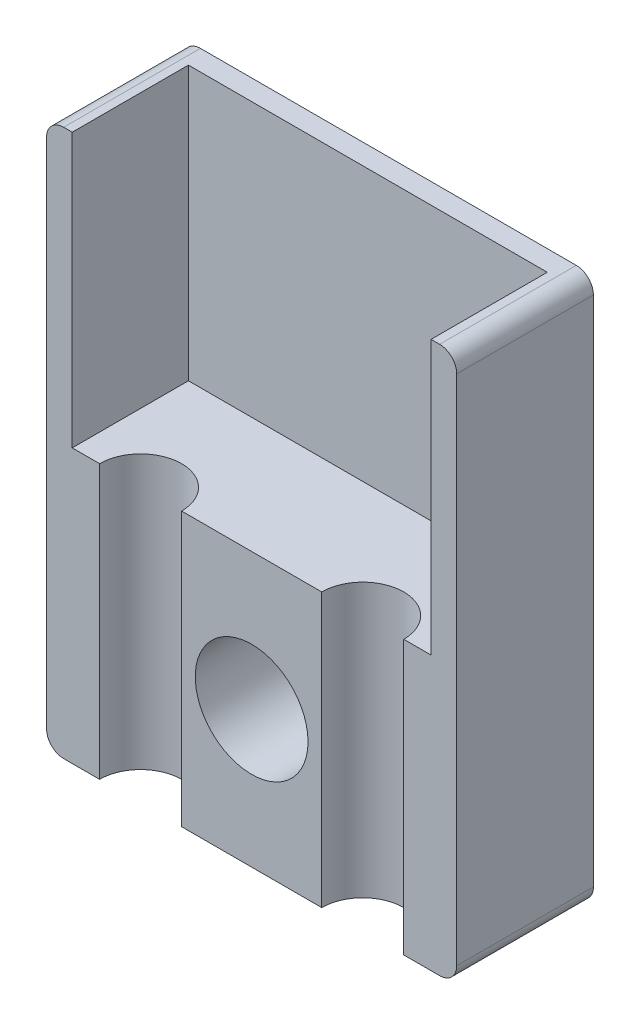
ISO-10303-21;
HEADER;
FILE_DESCRIPTION(('STEP AP214'),'2;1');
FILE_NAME('part.step','',(''),(''),'','','');
FILE_SCHEMA(('AUTOMOTIVE_DESIGN { 1 0 10303 214 1 1 1 1 }'));
ENDSEC;
DATA;
#1=APPLICATION_CONTEXT('core data for automotive mechanical design processes');
#2=APPLICATION_PROTOCOL_DEFINITION('international standard','automotive_design',2000,#1);
#3=PRODUCT_CONTEXT('',#1,'mechanical');
#4=PRODUCT('Part','Part','',(#3));
#5=PRODUCT_RELATED_PRODUCT_CATEGORY('part','',(#4));
#6=PRODUCT_DEFINITION_FORMATION('','',#4);
#7=PRODUCT_DEFINITION_CONTEXT('part definition',#1,'design');
#8=PRODUCT_DEFINITION('design','',#6,#7);
#9=PRODUCT_DEFINITION_SHAPE('','',#8);
#10=(LENGTH_UNIT() NAMED_UNIT(*) SI_UNIT(.MILLI.,.METRE.));
#11=(NAMED_UNIT(*) PLANE_ANGLE_UNIT() SI_UNIT($,.RADIAN.));
#12=(NAMED_UNIT(*) SI_UNIT($,.STERADIAN.) SOLID_ANGLE_UNIT());
#13=UNCERTAINTY_MEASURE_WITH_UNIT(LENGTH_MEASURE(1.E-05),#10,'distance_accuracy_value','');
#14=(GEOMETRIC_REPRESENTATION_CONTEXT(3) GLOBAL_UNCERTAINTY_ASSIGNED_CONTEXT((#13)) GLOBAL_UNIT_ASSIGNED_CONTEXT((#10,
#11,#12)) REPRESENTATION_CONTEXT('',''));
#15=CARTESIAN_POINT('',(0.,0.,0.));
#16=DIRECTION('',(0.,0.,1.));
#17=DIRECTION('',(1.,0.,0.));
#18=AXIS2_PLACEMENT_3D('',#15,#16,#17);
#19=CARTESIAN_POINT('',(11.5,15.5,4.));
#20=DIRECTION('',(0.,0.,-1.));
#21=DIRECTION('',(-1.,0.,0.));
#22=AXIS2_PLACEMENT_3D('',#19,#20,#21);
#23=PLANE('',#22);
#24=CARTESIAN_POINT('',(6.,4.,4.));
#25=DIRECTION('',(0.,0.,1.));
#26=DIRECTION('',(1.,0.,0.));
#27=AXIS2_PLACEMENT_3D('',#24,#25,#26);
#28=CIRCLE('',#27,1.65);
#29=CARTESIAN_POINT('',(7.65,4.,4.));
#30=VERTEX_POINT('',#29);
#31=EDGE_CURVE('E222',#30,#30,#28,.T.);
#32=ORIENTED_EDGE('',*,*,#31,.F.);
#33=EDGE_LOOP('',(#32));
#34=FACE_BOUND('',#33,.T.);
#35=DIRECTION('',(-1.,0.,0.));
#36=VECTOR('',#35,1.);
#37=CARTESIAN_POINT('',(11.25,8.,4.));
#38=LINE('',#37,#36);
#39=CARTESIAN_POINT('',(8.05,8.,4.));
#40=VERTEX_POINT('',#39);
#41=CARTESIAN_POINT('',(3.95,8.,4.));
#42=VERTEX_POINT('',#41);
#43=EDGE_CURVE('E345',#40,#42,#38,.T.);
#44=ORIENTED_EDGE('',*,*,#43,.T.);
#45=DIRECTION('',(0.,-1.,0.));
#46=VECTOR('',#45,1.);
#47=CARTESIAN_POINT('',(3.95,18.6832815729997,4.));
#48=LINE('',#47,#46);
#49=CARTESIAN_POINT('',(3.95,0.,4.));
#50=VERTEX_POINT('',#49);
#51=EDGE_CURVE('E208',#42,#50,#48,.T.);
#52=ORIENTED_EDGE('',*,*,#51,.T.);
#53=DIRECTION('',(1.,0.,0.));
#54=VECTOR('',#53,1.);
#55=CARTESIAN_POINT('',(0.500000000000004,0.,4.));
#56=LINE('',#55,#54);
#57=CARTESIAN_POINT('',(8.05,0.,4.));
#58=VERTEX_POINT('',#57);
#59=EDGE_CURVE('E254',#50,#58,#56,.T.);
#60=ORIENTED_EDGE('',*,*,#59,.T.);
#61=DIRECTION('',(0.,-1.,0.));
#62=VECTOR('',#61,1.);
#63=CARTESIAN_POINT('',(8.05,18.6832815729997,4.));
#64=LINE('',#63,#62);
#65=EDGE_CURVE('E64',#40,#58,#64,.T.);
#66=ORIENTED_EDGE('',*,*,#65,.F.);
#67=EDGE_LOOP('',(#44,#52,#60,#66));
#68=FACE_BOUND('',#67,.T.);
#69=ADVANCED_FACE('F41',(#34,#68),#23,.F.);
#70=CARTESIAN_POINT('',(9.25,18.6832815729997,4.));
#71=DIRECTION('',(0.,-1.,0.));
#72=DIRECTION('',(0.,0.,-1.));
#73=AXIS2_PLACEMENT_3D('',#70,#71,#72);
#74=CYLINDRICAL_SURFACE('',#73,1.2);
#75=CARTESIAN_POINT('',(9.25,8.,4.));
#76=DIRECTION('',(0.,1.,0.));
#77=DIRECTION('',(0.,0.,1.));
#78=AXIS2_PLACEMENT_3D('',#75,#76,#77);
#79=CIRCLE('',#78,1.2);
#80=CARTESIAN_POINT('',(10.45,8.,4.));
#81=VERTEX_POINT('',#80);
#82=EDGE_CURVE('E199',#40,#81,#79,.F.);
#83=ORIENTED_EDGE('',*,*,#82,.F.);
#84=ORIENTED_EDGE('',*,*,#65,.T.);
#85=CARTESIAN_POINT('',(9.25,0.,4.));
#86=DIRECTION('',(0.,-1.,0.));
#87=DIRECTION('',(0.,0.,-1.));
#88=AXIS2_PLACEMENT_3D('',#85,#86,#87);
#89=CIRCLE('',#88,1.2);
#90=CARTESIAN_POINT('',(10.45,0.,4.));
#91=VERTEX_POINT('',#90);
#92=EDGE_CURVE('E203',#58,#91,#89,.T.);
#93=ORIENTED_EDGE('',*,*,#92,.T.);
#94=DIRECTION('',(0.,-1.,0.));
#95=VECTOR('',#94,1.);
#96=CARTESIAN_POINT('',(10.45,18.6832815729997,4.));
#97=LINE('',#96,#95);
#98=EDGE_CURVE('E217',#81,#91,#97,.T.);
#99=ORIENTED_EDGE('',*,*,#98,.F.);
#100=EDGE_LOOP('',(#83,#84,#93,#99));
#101=FACE_BOUND('',#100,.T.);
#102=ADVANCED_FACE('F384',(#101),#74,.F.);
#103=CARTESIAN_POINT('',(2.75,18.6832815729997,4.));
#104=DIRECTION('',(0.,-1.,0.));
#105=DIRECTION('',(0.,0.,-1.));
#106=AXIS2_PLACEMENT_3D('',#103,#104,#105);
#107=CYLINDRICAL_SURFACE('',#106,1.2);
#108=CARTESIAN_POINT('',(2.75,8.,4.));
#109=DIRECTION('',(0.,1.,0.));
#110=DIRECTION('',(0.,0.,1.));
#111=AXIS2_PLACEMENT_3D('',#108,#109,#110);
#112=CIRCLE('',#111,1.2);
#113=CARTESIAN_POINT('',(1.55,8.,4.));
#114=VERTEX_POINT('',#113);
#115=EDGE_CURVE('E12',#114,#42,#112,.F.);
#116=ORIENTED_EDGE('',*,*,#115,.F.);
#117=DIRECTION('',(0.,-1.,0.));
#118=VECTOR('',#117,1.);
#119=CARTESIAN_POINT('',(1.55,18.6832815729997,4.));
#120=LINE('',#119,#118);
#121=CARTESIAN_POINT('',(1.55,0.,4.));
#122=VERTEX_POINT('',#121);
#123=EDGE_CURVE('E209',#114,#122,#120,.T.);
#124=ORIENTED_EDGE('',*,*,#123,.T.);
#125=CARTESIAN_POINT('',(2.75,0.,4.));
#126=DIRECTION('',(0.,-1.,0.));
#127=DIRECTION('',(0.,0.,-1.));
#128=AXIS2_PLACEMENT_3D('',#125,#126,#127);
#129=CIRCLE('',#128,1.2);
#130=EDGE_CURVE('E204',#122,#50,#129,.T.);
#131=ORIENTED_EDGE('',*,*,#130,.T.);
#132=ORIENTED_EDGE('',*,*,#51,.F.);
#133=EDGE_LOOP('',(#116,#124,#131,#132));
#134=FACE_BOUND('',#133,.T.);
#135=ADVANCED_FACE('F390',(#134),#107,.F.);
#136=DIRECTION('',(-1.,0.,0.));
#137=VECTOR('',#136,1.);
#138=CARTESIAN_POINT('',(0.500000000000004,16.,4.));
#139=LINE('',#138,#137);
#140=CARTESIAN_POINT('',(11.5,16.,4.));
#141=VERTEX_POINT('',#140);
#142=CARTESIAN_POINT('',(11.25,16.,4.));
#143=VERTEX_POINT('',#142);
#144=EDGE_CURVE('E236',#141,#143,#139,.T.);
#145=ORIENTED_EDGE('',*,*,#144,.T.);
#146=DIRECTION('',(0.,1.,0.));
#147=VECTOR('',#146,1.);
#148=CARTESIAN_POINT('',(11.25,-11.0367567699936,4.));
#149=LINE('',#148,#147);
#150=CARTESIAN_POINT('',(11.25,8.,4.));
#151=VERTEX_POINT('',#150);
#152=EDGE_CURVE('E175',#151,#143,#149,.T.);
#153=ORIENTED_EDGE('',*,*,#152,.F.);
#154=EDGE_CURVE('E342',#151,#81,#38,.T.);
#155=ORIENTED_EDGE('',*,*,#154,.T.);
#156=ORIENTED_EDGE('',*,*,#98,.T.);
#157=CARTESIAN_POINT('',(11.5,0.,4.));
#158=VERTEX_POINT('',#157);
#159=EDGE_CURVE('E248',#91,#158,#56,.T.);
#160=ORIENTED_EDGE('',*,*,#159,.T.);
#161=CARTESIAN_POINT('',(11.5,0.5,4.));
#162=DIRECTION('',(0.,0.,1.));
#163=DIRECTION('',(1.,0.,0.));
#164=AXIS2_PLACEMENT_3D('',#161,#162,#163);
#165=CIRCLE('',#164,0.5);
#166=CARTESIAN_POINT('',(12.,0.5,4.));
#167=VERTEX_POINT('',#166);
#168=EDGE_CURVE('E253',#158,#167,#165,.T.);
#169=ORIENTED_EDGE('',*,*,#168,.T.);
#170=DIRECTION('',(0.,1.,0.));
#171=VECTOR('',#170,1.);
#172=CARTESIAN_POINT('',(12.,0.500000000000004,4.));
#173=LINE('',#172,#171);
#174=CARTESIAN_POINT('',(12.,15.5,4.));
#175=VERTEX_POINT('',#174);
#176=EDGE_CURVE('E257',#167,#175,#173,.T.);
#177=ORIENTED_EDGE('',*,*,#176,.T.);
#178=CARTESIAN_POINT('',(11.5,15.5,4.));
#179=DIRECTION('',(0.,0.,1.));
#180=DIRECTION('',(-1.,0.,0.));
#181=AXIS2_PLACEMENT_3D('',#178,#179,#180);
#182=CIRCLE('',#181,0.5);
#183=EDGE_CURVE('E230',#175,#141,#182,.T.);
#184=ORIENTED_EDGE('',*,*,#183,.T.);
#185=EDGE_LOOP('',(#145,#153,#155,#156,#160,#169,#177,#184));
#186=FACE_BOUND('',#185,.T.);
#187=ADVANCED_FACE('F357',(#186),#23,.F.);
#188=CARTESIAN_POINT('',(0.750000000000004,8.,4.));
#189=VERTEX_POINT('',#188);
#190=EDGE_CURVE('E56',#114,#189,#38,.T.);
#191=ORIENTED_EDGE('',*,*,#190,.T.);
#192=DIRECTION('',(0.,1.,0.));
#193=VECTOR('',#192,1.);
#194=CARTESIAN_POINT('',(0.750000000000004,-11.0367567699936,4.));
#195=LINE('',#194,#193);
#196=CARTESIAN_POINT('',(0.750000000000004,16.,4.));
#197=VERTEX_POINT('',#196);
#198=EDGE_CURVE('E191',#189,#197,#195,.T.);
#199=ORIENTED_EDGE('',*,*,#198,.T.);
#200=CARTESIAN_POINT('',(0.500000000000004,16.,4.));
#201=VERTEX_POINT('',#200);
#202=EDGE_CURVE('E234',#197,#201,#139,.T.);
#203=ORIENTED_EDGE('',*,*,#202,.T.);
#204=CARTESIAN_POINT('',(0.5,15.5,4.));
#205=DIRECTION('',(0.,0.,1.));
#206=DIRECTION('',(-1.,0.,0.));
#207=AXIS2_PLACEMENT_3D('',#204,#205,#206);
#208=CIRCLE('',#207,0.5);
#209=CARTESIAN_POINT('',(0.,15.5,4.));
#210=VERTEX_POINT('',#209);
#211=EDGE_CURVE('E239',#201,#210,#208,.T.);
#212=ORIENTED_EDGE('',*,*,#211,.T.);
#213=DIRECTION('',(0.,-1.,0.));
#214=VECTOR('',#213,1.);
#215=CARTESIAN_POINT('',(0.,0.500000000000004,4.));
#216=LINE('',#215,#214);
#217=CARTESIAN_POINT('',(0.,0.500000000000004,4.));
#218=VERTEX_POINT('',#217);
#219=EDGE_CURVE('E242',#210,#218,#216,.T.);
#220=ORIENTED_EDGE('',*,*,#219,.T.);
#221=CARTESIAN_POINT('',(0.5,0.5,4.));
#222=DIRECTION('',(0.,0.,1.));
#223=DIRECTION('',(-1.,0.,0.));
#224=AXIS2_PLACEMENT_3D('',#221,#222,#223);
#225=CIRCLE('',#224,0.5);
#226=CARTESIAN_POINT('',(0.500000000000004,0.,4.));
#227=VERTEX_POINT('',#226);
#228=EDGE_CURVE('E245',#218,#227,#225,.T.);
#229=ORIENTED_EDGE('',*,*,#228,.T.);
#230=EDGE_CURVE('E249',#227,#122,#56,.T.);
#231=ORIENTED_EDGE('',*,*,#230,.T.);
#232=ORIENTED_EDGE('',*,*,#123,.F.);
#233=EDGE_LOOP('',(#191,#199,#203,#212,#220,#229,#231,#232));
#234=FACE_BOUND('',#233,.T.);
#235=ADVANCED_FACE('F336',(#234),#23,.F.);
#236=CARTESIAN_POINT('',(11.5,15.5,0.));
#237=DIRECTION('',(0.,0.,-1.));
#238=DIRECTION('',(-1.,0.,0.));
#239=AXIS2_PLACEMENT_3D('',#236,#237,#238);
#240=PLANE('',#239);
#241=CARTESIAN_POINT('',(11.5,15.5,0.));
#242=DIRECTION('',(0.,0.,1.));
#243=DIRECTION('',(-1.,0.,0.));
#244=AXIS2_PLACEMENT_3D('',#241,#242,#243);
#245=CIRCLE('',#244,0.5);
#246=CARTESIAN_POINT('',(12.,15.5,0.));
#247=VERTEX_POINT('',#246);
#248=CARTESIAN_POINT('',(11.5,16.,0.));
#249=VERTEX_POINT('',#248);
#250=EDGE_CURVE('E226',#247,#249,#245,.T.);
#251=ORIENTED_EDGE('',*,*,#250,.F.);
#252=DIRECTION('',(0.,1.,0.));
#253=VECTOR('',#252,1.);
#254=CARTESIAN_POINT('',(12.,0.500000000000004,0.));
#255=LINE('',#254,#253);
#256=CARTESIAN_POINT('',(12.,0.5,0.));
#257=VERTEX_POINT('',#256);
#258=EDGE_CURVE('E235',#257,#247,#255,.T.);
#259=ORIENTED_EDGE('',*,*,#258,.F.);
#260=CARTESIAN_POINT('',(11.5,0.5,0.));
#261=DIRECTION('',(0.,0.,1.));
#262=DIRECTION('',(1.,0.,0.));
#263=AXIS2_PLACEMENT_3D('',#260,#261,#262);
#264=CIRCLE('',#263,0.5);
#265=CARTESIAN_POINT('',(11.5,0.,0.));
#266=VERTEX_POINT('',#265);
#267=EDGE_CURVE('E279',#266,#257,#264,.T.);
#268=ORIENTED_EDGE('',*,*,#267,.F.);
#269=DIRECTION('',(1.,0.,0.));
#270=VECTOR('',#269,1.);
#271=CARTESIAN_POINT('',(0.500000000000004,0.,0.));
#272=LINE('',#271,#270);
#273=CARTESIAN_POINT('',(0.500000000000004,0.,0.));
#274=VERTEX_POINT('',#273);
#275=EDGE_CURVE('E276',#274,#266,#272,.T.);
#276=ORIENTED_EDGE('',*,*,#275,.F.);
#277=CARTESIAN_POINT('',(0.5,0.5,0.));
#278=DIRECTION('',(0.,0.,1.));
#279=DIRECTION('',(-1.,0.,0.));
#280=AXIS2_PLACEMENT_3D('',#277,#278,#279);
#281=CIRCLE('',#280,0.5);
#282=CARTESIAN_POINT('',(0.,0.500000000000004,0.));
#283=VERTEX_POINT('',#282);
#284=EDGE_CURVE('E273',#283,#274,#281,.T.);
#285=ORIENTED_EDGE('',*,*,#284,.F.);
#286=DIRECTION('',(0.,-1.,0.));
#287=VECTOR('',#286,1.);
#288=CARTESIAN_POINT('',(0.,0.500000000000004,0.));
#289=LINE('',#288,#287);
#290=CARTESIAN_POINT('',(0.,15.5,0.));
#291=VERTEX_POINT('',#290);
#292=EDGE_CURVE('E270',#291,#283,#289,.T.);
#293=ORIENTED_EDGE('',*,*,#292,.F.);
#294=CARTESIAN_POINT('',(0.5,15.5,0.));
#295=DIRECTION('',(0.,0.,1.));
#296=DIRECTION('',(-1.,0.,0.));
#297=AXIS2_PLACEMENT_3D('',#294,#295,#296);
#298=CIRCLE('',#297,0.5);
#299=CARTESIAN_POINT('',(0.500000000000004,16.,0.));
#300=VERTEX_POINT('',#299);
#301=EDGE_CURVE('E267',#300,#291,#298,.T.);
#302=ORIENTED_EDGE('',*,*,#301,.F.);
#303=DIRECTION('',(-1.,0.,0.));
#304=VECTOR('',#303,1.);
#305=CARTESIAN_POINT('',(0.500000000000004,16.,0.));
#306=LINE('',#305,#304);
#307=EDGE_CURVE('E264',#249,#300,#306,.T.);
#308=ORIENTED_EDGE('',*,*,#307,.F.);
#309=EDGE_LOOP('',(#251,#259,#268,#276,#285,#293,#302,#308));
#310=FACE_BOUND('',#309,.T.);
#311=CARTESIAN_POINT('',(6.,4.,0.));
#312=DIRECTION('',(0.,0.,1.));
#313=DIRECTION('',(1.,0.,0.));
#314=AXIS2_PLACEMENT_3D('',#311,#312,#313);
#315=CIRCLE('',#314,1.65);
#316=CARTESIAN_POINT('',(7.65,4.,0.));
#317=VERTEX_POINT('',#316);
#318=EDGE_CURVE('E212',#317,#317,#315,.T.);
#319=ORIENTED_EDGE('',*,*,#318,.T.);
#320=EDGE_LOOP('',(#319));
#321=FACE_BOUND('',#320,.T.);
#322=ADVANCED_FACE('F320',(#310,#321),#240,.T.);
#323=CARTESIAN_POINT('',(11.5,15.5,4.));
#324=DIRECTION('',(0.,0.,-1.));
#325=DIRECTION('',(-1.,0.,0.));
#326=AXIS2_PLACEMENT_3D('',#323,#324,#325);
#327=CYLINDRICAL_SURFACE('',#326,0.5);
#328=ORIENTED_EDGE('',*,*,#250,.T.);
#329=DIRECTION('',(0.,0.,-1.));
#330=VECTOR('',#329,1.);
#331=CARTESIAN_POINT('',(11.5,16.,4.));
#332=LINE('',#331,#330);
#333=EDGE_CURVE('E50',#141,#249,#332,.T.);
#334=ORIENTED_EDGE('',*,*,#333,.F.);
#335=ORIENTED_EDGE('',*,*,#183,.F.);
#336=DIRECTION('',(0.,0.,-1.));
#337=VECTOR('',#336,1.);
#338=CARTESIAN_POINT('',(12.,15.5,4.));
#339=LINE('',#338,#337);
#340=EDGE_CURVE('E260',#175,#247,#339,.T.);
#341=ORIENTED_EDGE('',*,*,#340,.T.);
#342=EDGE_LOOP('',(#328,#334,#335,#341));
#343=FACE_BOUND('',#342,.T.);
#344=ADVANCED_FACE('F43',(#343),#327,.T.);
#345=CARTESIAN_POINT('',(0.500000000000004,16.,4.));
#346=DIRECTION('',(0.,-1.,0.));
#347=DIRECTION('',(0.,0.,-1.));
#348=AXIS2_PLACEMENT_3D('',#345,#346,#347);
#349=PLANE('',#348);
#350=DIRECTION('',(-1.,0.,0.));
#351=VECTOR('',#350,1.);
#352=CARTESIAN_POINT('',(11.25,16.,0.6));
#353=LINE('',#352,#351);
#354=CARTESIAN_POINT('',(11.25,16.,0.6));
#355=VERTEX_POINT('',#354);
#356=CARTESIAN_POINT('',(0.750000000000004,16.,0.6));
#357=VERTEX_POINT('',#356);
#358=EDGE_CURVE('E161',#355,#357,#353,.T.);
#359=ORIENTED_EDGE('',*,*,#358,.F.);
#360=DIRECTION('',(0.,0.,-1.));
#361=VECTOR('',#360,1.);
#362=CARTESIAN_POINT('',(11.25,16.,4.));
#363=LINE('',#362,#361);
#364=EDGE_CURVE('E172',#143,#355,#363,.T.);
#365=ORIENTED_EDGE('',*,*,#364,.F.);
#366=ORIENTED_EDGE('',*,*,#144,.F.);
#367=ORIENTED_EDGE('',*,*,#333,.T.);
#368=ORIENTED_EDGE('',*,*,#307,.T.);
#369=DIRECTION('',(0.,0.,-1.));
#370=VECTOR('',#369,1.);
#371=CARTESIAN_POINT('',(0.500000000000004,16.,4.));
#372=LINE('',#371,#370);
#373=EDGE_CURVE('E307',#201,#300,#372,.T.);
#374=ORIENTED_EDGE('',*,*,#373,.F.);
#375=ORIENTED_EDGE('',*,*,#202,.F.);
#376=DIRECTION('',(0.,0.,1.));
#377=VECTOR('',#376,1.);
#378=CARTESIAN_POINT('',(0.750000000000004,16.,4.));
#379=LINE('',#378,#377);
#380=EDGE_CURVE('E169',#357,#197,#379,.T.);
#381=ORIENTED_EDGE('',*,*,#380,.F.);
#382=EDGE_LOOP('',(#359,#365,#366,#367,#368,#374,#375,#381));
#383=FACE_BOUND('',#382,.T.);
#384=ADVANCED_FACE('F180',(#383),#349,.F.);
#385=CARTESIAN_POINT('',(0.5,15.5,4.));
#386=DIRECTION('',(0.,0.,-1.));
#387=DIRECTION('',(-1.,0.,0.));
#388=AXIS2_PLACEMENT_3D('',#385,#386,#387);
#389=CYLINDRICAL_SURFACE('',#388,0.5);
#390=ORIENTED_EDGE('',*,*,#301,.T.);
#391=DIRECTION('',(0.,0.,-1.));
#392=VECTOR('',#391,1.);
#393=CARTESIAN_POINT('',(0.,15.5,4.));
#394=LINE('',#393,#392);
#395=EDGE_CURVE('E303',#210,#291,#394,.T.);
#396=ORIENTED_EDGE('',*,*,#395,.F.);
#397=ORIENTED_EDGE('',*,*,#211,.F.);
#398=ORIENTED_EDGE('',*,*,#373,.T.);
#399=EDGE_LOOP('',(#390,#396,#397,#398));
#400=FACE_BOUND('',#399,.T.);
#401=ADVANCED_FACE('F328',(#400),#389,.T.);
#402=CARTESIAN_POINT('',(0.,0.500000000000004,4.));
#403=DIRECTION('',(1.,0.,0.));
#404=DIRECTION('',(0.,0.,-1.));
#405=AXIS2_PLACEMENT_3D('',#402,#403,#404);
#406=PLANE('',#405);
#407=ORIENTED_EDGE('',*,*,#292,.T.);
#408=DIRECTION('',(0.,0.,-1.));
#409=VECTOR('',#408,1.);
#410=CARTESIAN_POINT('',(0.,0.500000000000004,4.));
#411=LINE('',#410,#409);
#412=EDGE_CURVE('E299',#218,#283,#411,.T.);
#413=ORIENTED_EDGE('',*,*,#412,.F.);
#414=ORIENTED_EDGE('',*,*,#219,.F.);
#415=ORIENTED_EDGE('',*,*,#395,.T.);
#416=EDGE_LOOP('',(#407,#413,#414,#415));
#417=FACE_BOUND('',#416,.T.);
#418=ADVANCED_FACE('F332',(#417),#406,.F.);
#419=CARTESIAN_POINT('',(0.5,0.5,4.));
#420=DIRECTION('',(0.,0.,-1.));
#421=DIRECTION('',(-1.,0.,0.));
#422=AXIS2_PLACEMENT_3D('',#419,#420,#421);
#423=CYLINDRICAL_SURFACE('',#422,0.5);
#424=ORIENTED_EDGE('',*,*,#284,.T.);
#425=DIRECTION('',(0.,0.,-1.));
#426=VECTOR('',#425,1.);
#427=CARTESIAN_POINT('',(0.500000000000004,0.,4.));
#428=LINE('',#427,#426);
#429=EDGE_CURVE('E295',#227,#274,#428,.T.);
#430=ORIENTED_EDGE('',*,*,#429,.F.);
#431=ORIENTED_EDGE('',*,*,#228,.F.);
#432=ORIENTED_EDGE('',*,*,#412,.T.);
#433=EDGE_LOOP('',(#424,#430,#431,#432));
#434=FACE_BOUND('',#433,.T.);
#435=ADVANCED_FACE('F374',(#434),#423,.T.);
#436=CARTESIAN_POINT('',(0.500000000000004,0.,4.));
#437=DIRECTION('',(0.,1.,0.));
#438=DIRECTION('',(0.,0.,1.));
#439=AXIS2_PLACEMENT_3D('',#436,#437,#438);
#440=PLANE('',#439);
#441=ORIENTED_EDGE('',*,*,#59,.F.);
#442=ORIENTED_EDGE('',*,*,#130,.F.);
#443=ORIENTED_EDGE('',*,*,#230,.F.);
#444=ORIENTED_EDGE('',*,*,#429,.T.);
#445=ORIENTED_EDGE('',*,*,#275,.T.);
#446=DIRECTION('',(0.,0.,-1.));
#447=VECTOR('',#446,1.);
#448=CARTESIAN_POINT('',(11.5,0.,4.));
#449=LINE('',#448,#447);
#450=EDGE_CURVE('E291',#158,#266,#449,.T.);
#451=ORIENTED_EDGE('',*,*,#450,.F.);
#452=ORIENTED_EDGE('',*,*,#159,.F.);
#453=ORIENTED_EDGE('',*,*,#92,.F.);
#454=EDGE_LOOP('',(#441,#442,#443,#444,#445,#451,#452,#453));
#455=FACE_BOUND('',#454,.T.);
#456=ADVANCED_FACE('F369',(#455),#440,.F.);
#457=CARTESIAN_POINT('',(11.5,0.5,4.));
#458=DIRECTION('',(0.,0.,-1.));
#459=DIRECTION('',(-1.,0.,0.));
#460=AXIS2_PLACEMENT_3D('',#457,#458,#459);
#461=CYLINDRICAL_SURFACE('',#460,0.5);
#462=ORIENTED_EDGE('',*,*,#267,.T.);
#463=DIRECTION('',(0.,0.,-1.));
#464=VECTOR('',#463,1.);
#465=CARTESIAN_POINT('',(12.,0.5,4.));
#466=LINE('',#465,#464);
#467=EDGE_CURVE('E287',#167,#257,#466,.T.);
#468=ORIENTED_EDGE('',*,*,#467,.F.);
#469=ORIENTED_EDGE('',*,*,#168,.F.);
#470=ORIENTED_EDGE('',*,*,#450,.T.);
#471=EDGE_LOOP('',(#462,#468,#469,#470));
#472=FACE_BOUND('',#471,.T.);
#473=ADVANCED_FACE('F364',(#472),#461,.T.);
#474=CARTESIAN_POINT('',(12.,0.500000000000004,4.));
#475=DIRECTION('',(-1.,0.,0.));
#476=DIRECTION('',(0.,0.,1.));
#477=AXIS2_PLACEMENT_3D('',#474,#475,#476);
#478=PLANE('',#477);
#479=ORIENTED_EDGE('',*,*,#258,.T.);
#480=ORIENTED_EDGE('',*,*,#340,.F.);
#481=ORIENTED_EDGE('',*,*,#176,.F.);
#482=ORIENTED_EDGE('',*,*,#467,.T.);
#483=EDGE_LOOP('',(#479,#480,#481,#482));
#484=FACE_BOUND('',#483,.T.);
#485=ADVANCED_FACE('F362',(#484),#478,.F.);
#486=CARTESIAN_POINT('',(6.,4.,4.));
#487=DIRECTION('',(0.,0.,-1.));
#488=DIRECTION('',(-1.,0.,0.));
#489=AXIS2_PLACEMENT_3D('',#486,#487,#488);
#490=CYLINDRICAL_SURFACE('',#489,1.65);
#491=ORIENTED_EDGE('',*,*,#31,.T.);
#492=EDGE_LOOP('',(#491));
#493=FACE_BOUND('',#492,.T.);
#494=ORIENTED_EDGE('',*,*,#318,.F.);
#495=EDGE_LOOP('',(#494));
#496=FACE_BOUND('',#495,.T.);
#497=ADVANCED_FACE('F407',(#493,#496),#490,.F.);
#498=CARTESIAN_POINT('',(0.500000000000004,8.,4.));
#499=DIRECTION('',(0.,1.,0.));
#500=DIRECTION('',(0.,0.,1.));
#501=AXIS2_PLACEMENT_3D('',#498,#499,#500);
#502=PLANE('',#501);
#503=ORIENTED_EDGE('',*,*,#82,.T.);
#504=ORIENTED_EDGE('',*,*,#154,.F.);
#505=DIRECTION('',(0.,0.,1.));
#506=VECTOR('',#505,1.);
#507=CARTESIAN_POINT('',(11.25,8.,4.));
#508=LINE('',#507,#506);
#509=CARTESIAN_POINT('',(11.25,8.,0.6));
#510=VERTEX_POINT('',#509);
#511=EDGE_CURVE('E200',#510,#151,#508,.T.);
#512=ORIENTED_EDGE('',*,*,#511,.F.);
#513=DIRECTION('',(1.,0.,0.));
#514=VECTOR('',#513,1.);
#515=CARTESIAN_POINT('',(11.25,8.,0.6));
#516=LINE('',#515,#514);
#517=CARTESIAN_POINT('',(0.750000000000004,8.,0.6));
#518=VERTEX_POINT('',#517);
#519=EDGE_CURVE('E164',#518,#510,#516,.T.);
#520=ORIENTED_EDGE('',*,*,#519,.F.);
#521=DIRECTION('',(0.,0.,-1.));
#522=VECTOR('',#521,1.);
#523=CARTESIAN_POINT('',(0.750000000000004,8.,4.));
#524=LINE('',#523,#522);
#525=EDGE_CURVE('E190',#189,#518,#524,.T.);
#526=ORIENTED_EDGE('',*,*,#525,.F.);
#527=ORIENTED_EDGE('',*,*,#190,.F.);
#528=ORIENTED_EDGE('',*,*,#115,.T.);
#529=ORIENTED_EDGE('',*,*,#43,.F.);
#530=EDGE_LOOP('',(#503,#504,#512,#520,#526,#527,#528,#529));
#531=FACE_BOUND('',#530,.T.);
#532=ADVANCED_FACE('F353',(#531),#502,.T.);
#533=CARTESIAN_POINT('',(11.25,-11.0367567699936,4.));
#534=DIRECTION('',(1.,0.,0.));
#535=DIRECTION('',(0.,0.,-1.));
#536=AXIS2_PLACEMENT_3D('',#533,#534,#535);
#537=PLANE('',#536);
#538=ORIENTED_EDGE('',*,*,#511,.T.);
#539=ORIENTED_EDGE('',*,*,#152,.T.);
#540=ORIENTED_EDGE('',*,*,#364,.T.);
#541=DIRECTION('',(0.,1.,0.));
#542=VECTOR('',#541,1.);
#543=CARTESIAN_POINT('',(11.25,-11.0367567699936,0.6));
#544=LINE('',#543,#542);
#545=EDGE_CURVE('E156',#510,#355,#544,.T.);
#546=ORIENTED_EDGE('',*,*,#545,.F.);
#547=EDGE_LOOP('',(#538,#539,#540,#546));
#548=FACE_BOUND('',#547,.T.);
#549=ADVANCED_FACE('F173',(#548),#537,.F.);
#550=CARTESIAN_POINT('',(0.750000000000004,-11.0367567699936,4.));
#551=DIRECTION('',(-1.,0.,0.));
#552=DIRECTION('',(0.,0.,1.));
#553=AXIS2_PLACEMENT_3D('',#550,#551,#552);
#554=PLANE('',#553);
#555=ORIENTED_EDGE('',*,*,#525,.T.);
#556=DIRECTION('',(0.,1.,0.));
#557=VECTOR('',#556,1.);
#558=CARTESIAN_POINT('',(0.750000000000004,-11.0367567699936,0.6));
#559=LINE('',#558,#557);
#560=EDGE_CURVE('E168',#518,#357,#559,.T.);
#561=ORIENTED_EDGE('',*,*,#560,.T.);
#562=ORIENTED_EDGE('',*,*,#380,.T.);
#563=ORIENTED_EDGE('',*,*,#198,.F.);
#564=EDGE_LOOP('',(#555,#561,#562,#563));
#565=FACE_BOUND('',#564,.T.);
#566=ADVANCED_FACE('F352',(#565),#554,.F.);
#567=CARTESIAN_POINT('',(11.25,-11.0367567699936,0.6));
#568=DIRECTION('',(0.,0.,-1.));
#569=DIRECTION('',(-1.,0.,0.));
#570=AXIS2_PLACEMENT_3D('',#567,#568,#569);
#571=PLANE('',#570);
#572=ORIENTED_EDGE('',*,*,#519,.T.);
#573=ORIENTED_EDGE('',*,*,#545,.T.);
#574=ORIENTED_EDGE('',*,*,#358,.T.);
#575=ORIENTED_EDGE('',*,*,#560,.F.);
#576=EDGE_LOOP('',(#572,#573,#574,#575));
#577=FACE_BOUND('',#576,.T.);
#578=ADVANCED_FACE('F158',(#577),#571,.F.);
#579=CLOSED_SHELL('',(#69,#102,#135,#187,#235,#322,#344,#384,#401,#418,#435,#456,#473,#485,#497,
#532,#549,#566,#578));
#580=MANIFOLD_SOLID_BREP('B2',#579);
#581=ADVANCED_BREP_SHAPE_REPRESENTATION('',(#18,#580),#14);
#582=SHAPE_DEFINITION_REPRESENTATION(#9,#581);
ENDSEC;
END-ISO-10303-21;
